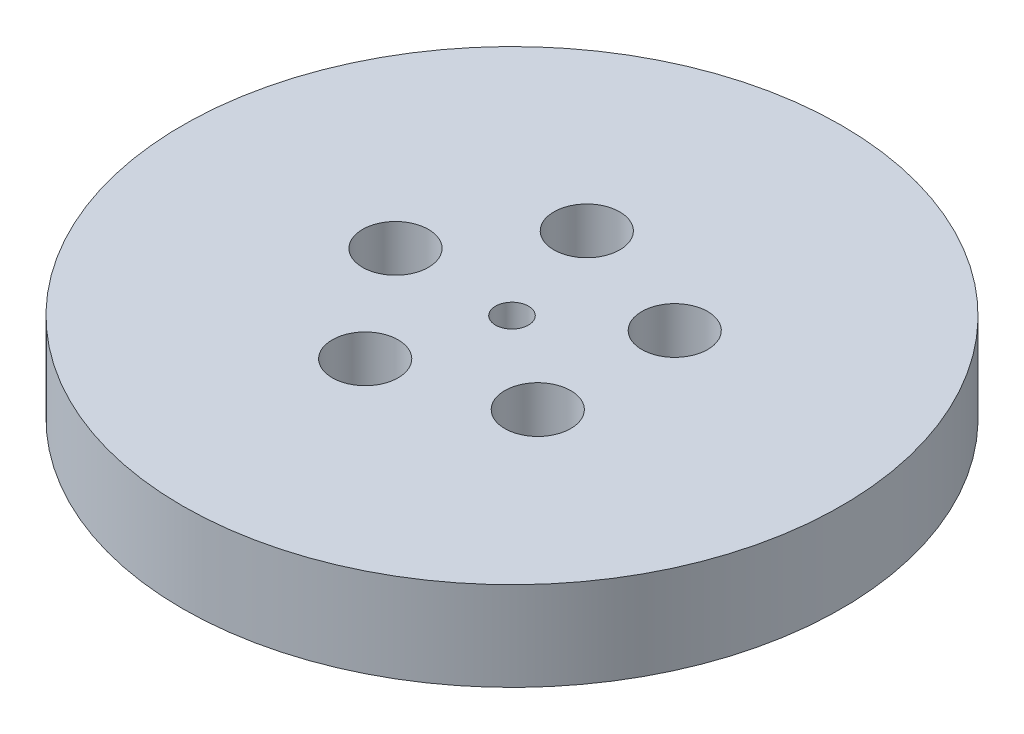
ISO-10303-21;
HEADER;
FILE_DESCRIPTION(('STEP AP214'),'2;1');
FILE_NAME('part.step','',(''),(''),'','','');
FILE_SCHEMA(('AUTOMOTIVE_DESIGN { 1 0 10303 214 1 1 1 1 }'));
ENDSEC;
DATA;
#1=APPLICATION_CONTEXT('core data for automotive mechanical design processes');
#2=APPLICATION_PROTOCOL_DEFINITION('international standard','automotive_design',2000,#1);
#3=PRODUCT_CONTEXT('',#1,'mechanical');
#4=PRODUCT('Part','Part','',(#3));
#5=PRODUCT_RELATED_PRODUCT_CATEGORY('part','',(#4));
#6=PRODUCT_DEFINITION_FORMATION('','',#4);
#7=PRODUCT_DEFINITION_CONTEXT('part definition',#1,'design');
#8=PRODUCT_DEFINITION('design','',#6,#7);
#9=PRODUCT_DEFINITION_SHAPE('','',#8);
#10=(LENGTH_UNIT() NAMED_UNIT(*) SI_UNIT(.MILLI.,.METRE.));
#11=(NAMED_UNIT(*) PLANE_ANGLE_UNIT() SI_UNIT($,.RADIAN.));
#12=(NAMED_UNIT(*) SI_UNIT($,.STERADIAN.) SOLID_ANGLE_UNIT());
#13=UNCERTAINTY_MEASURE_WITH_UNIT(LENGTH_MEASURE(1.E-05),#10,'distance_accuracy_value','');
#14=(GEOMETRIC_REPRESENTATION_CONTEXT(3) GLOBAL_UNCERTAINTY_ASSIGNED_CONTEXT((#13)) GLOBAL_UNIT_ASSIGNED_CONTEXT((#10,
#11,#12)) REPRESENTATION_CONTEXT('',''));
#15=CARTESIAN_POINT('',(0.,0.,0.));
#16=DIRECTION('',(0.,0.,1.));
#17=DIRECTION('',(1.,0.,0.));
#18=AXIS2_PLACEMENT_3D('',#15,#16,#17);
#19=CARTESIAN_POINT('',(0.,27.,0.));
#20=DIRECTION('',(0.,-1.,0.));
#21=DIRECTION('',(0.,0.,-1.));
#22=AXIS2_PLACEMENT_3D('',#19,#20,#21);
#23=CYLINDRICAL_SURFACE('',#22,100.);
#24=CARTESIAN_POINT('',(0.,27.,0.));
#25=DIRECTION('',(0.,1.,0.));
#26=DIRECTION('',(0.,0.,1.));
#27=AXIS2_PLACEMENT_3D('',#24,#25,#26);
#28=CIRCLE('',#27,100.);
#29=CARTESIAN_POINT('',(0.,27.,100.));
#30=VERTEX_POINT('',#29);
#31=EDGE_CURVE('E10',#30,#30,#28,.T.);
#32=ORIENTED_EDGE('',*,*,#31,.F.);
#33=EDGE_LOOP('',(#32));
#34=FACE_BOUND('',#33,.T.);
#35=CARTESIAN_POINT('',(0.,0.,0.));
#36=DIRECTION('',(0.,1.,0.));
#37=DIRECTION('',(0.,0.,1.));
#38=AXIS2_PLACEMENT_3D('',#35,#36,#37);
#39=CIRCLE('',#38,100.);
#40=CARTESIAN_POINT('',(0.,0.,100.));
#41=VERTEX_POINT('',#40);
#42=EDGE_CURVE('E37',#41,#41,#39,.T.);
#43=ORIENTED_EDGE('',*,*,#42,.T.);
#44=EDGE_LOOP('',(#43));
#45=FACE_BOUND('',#44,.T.);
#46=ADVANCED_FACE('F40',(#34,#45),#23,.T.);
#47=CARTESIAN_POINT('',(0.,27.,0.));
#48=DIRECTION('',(0.,1.,0.));
#49=DIRECTION('',(0.,0.,1.));
#50=AXIS2_PLACEMENT_3D('',#47,#48,#49);
#51=PLANE('',#50);
#52=CARTESIAN_POINT('',(-10.9241013557288,27.,-33.620926900959));
#53=DIRECTION('',(0.,1.,0.));
#54=DIRECTION('',(-0.95105651629515,0.,0.309016994374958));
#55=AXIS2_PLACEMENT_3D('',#52,#53,#54);
#56=CIRCLE('',#55,10.);
#57=CARTESIAN_POINT('',(-20.4346665186803,27.,-30.5307569572094));
#58=VERTEX_POINT('',#57);
#59=EDGE_CURVE('E70',#58,#58,#56,.T.);
#60=ORIENTED_EDGE('',*,*,#59,.F.);
#61=EDGE_LOOP('',(#60));
#62=FACE_BOUND('',#61,.T.);
#63=CARTESIAN_POINT('',(28.5996686458455,27.,-20.7788755580686));
#64=DIRECTION('',(0.,1.,0.));
#65=DIRECTION('',(-0.58778525229248,0.,-0.809016994374942));
#66=AXIS2_PLACEMENT_3D('',#63,#64,#65);
#67=CIRCLE('',#66,10.);
#68=CARTESIAN_POINT('',(22.7218161229207,27.,-28.8690455018181));
#69=VERTEX_POINT('',#68);
#70=EDGE_CURVE('E71',#69,#69,#67,.T.);
#71=ORIENTED_EDGE('',*,*,#70,.F.);
#72=EDGE_LOOP('',(#71));
#73=FACE_BOUND('',#72,.T.);
#74=CARTESIAN_POINT('',(28.5996686458458,27.,20.7788755580682));
#75=DIRECTION('',(0.,1.,0.));
#76=DIRECTION('',(0.587785252292469,0.,-0.809016994374951));
#77=AXIS2_PLACEMENT_3D('',#74,#75,#76);
#78=CIRCLE('',#77,10.);
#79=CARTESIAN_POINT('',(34.4775211687705,27.,12.6887056143187));
#80=VERTEX_POINT('',#79);
#81=EDGE_CURVE('E78',#80,#80,#78,.T.);
#82=ORIENTED_EDGE('',*,*,#81,.F.);
#83=EDGE_LOOP('',(#82));
#84=FACE_BOUND('',#83,.T.);
#85=CARTESIAN_POINT('',(-10.9241013557283,27.,33.6209269009591));
#86=DIRECTION('',(0.,1.,0.));
#87=DIRECTION('',(0.951056516295155,0.,0.309016994374945));
#88=AXIS2_PLACEMENT_3D('',#85,#86,#87);
#89=CIRCLE('',#88,10.);
#90=CARTESIAN_POINT('',(-1.41353619277674,27.,36.7110968447086));
#91=VERTEX_POINT('',#90);
#92=EDGE_CURVE('E61',#91,#91,#89,.T.);
#93=ORIENTED_EDGE('',*,*,#92,.F.);
#94=EDGE_LOOP('',(#93));
#95=FACE_BOUND('',#94,.T.);
#96=CARTESIAN_POINT('',(-35.3511345802346,27.,0.));
#97=DIRECTION('',(0.,1.,0.));
#98=DIRECTION('',(0.,0.,1.));
#99=AXIS2_PLACEMENT_3D('',#96,#97,#98);
#100=CIRCLE('',#99,10.);
#101=CARTESIAN_POINT('',(-35.3511345802346,27.,10.));
#102=VERTEX_POINT('',#101);
#103=EDGE_CURVE('E54',#102,#102,#100,.T.);
#104=ORIENTED_EDGE('',*,*,#103,.F.);
#105=EDGE_LOOP('',(#104));
#106=FACE_BOUND('',#105,.T.);
#107=CARTESIAN_POINT('',(0.,27.,0.));
#108=DIRECTION('',(0.,1.,0.));
#109=DIRECTION('',(0.,0.,1.));
#110=AXIS2_PLACEMENT_3D('',#107,#108,#109);
#111=CIRCLE('',#110,5.);
#112=CARTESIAN_POINT('',(0.,27.,5.));
#113=VERTEX_POINT('',#112);
#114=EDGE_CURVE('E50',#113,#113,#111,.T.);
#115=ORIENTED_EDGE('',*,*,#114,.F.);
#116=EDGE_LOOP('',(#115));
#117=FACE_BOUND('',#116,.T.);
#118=ORIENTED_EDGE('',*,*,#31,.T.);
#119=EDGE_LOOP('',(#118));
#120=FACE_BOUND('',#119,.T.);
#121=ADVANCED_FACE('F94',(#62,#73,#84,#95,#106,#117,#120),#51,.T.);
#122=CARTESIAN_POINT('',(0.,0.,0.));
#123=DIRECTION('',(0.,1.,0.));
#124=DIRECTION('',(0.,0.,1.));
#125=AXIS2_PLACEMENT_3D('',#122,#123,#124);
#126=PLANE('',#125);
#127=CARTESIAN_POINT('',(0.,0.,0.));
#128=DIRECTION('',(0.,1.,0.));
#129=DIRECTION('',(0.,0.,1.));
#130=AXIS2_PLACEMENT_3D('',#127,#128,#129);
#131=CIRCLE('',#130,5.);
#132=CARTESIAN_POINT('',(0.,0.,5.));
#133=VERTEX_POINT('',#132);
#134=EDGE_CURVE('E47',#133,#133,#131,.T.);
#135=ORIENTED_EDGE('',*,*,#134,.T.);
#136=EDGE_LOOP('',(#135));
#137=FACE_BOUND('',#136,.T.);
#138=ORIENTED_EDGE('',*,*,#42,.F.);
#139=EDGE_LOOP('',(#138));
#140=FACE_BOUND('',#139,.T.);
#141=ADVANCED_FACE('F100',(#137,#140),#126,.F.);
#142=CARTESIAN_POINT('',(0.,27.,0.));
#143=DIRECTION('',(0.,-1.,0.));
#144=DIRECTION('',(0.,0.,-1.));
#145=AXIS2_PLACEMENT_3D('',#142,#143,#144);
#146=CYLINDRICAL_SURFACE('',#145,5.);
#147=ORIENTED_EDGE('',*,*,#114,.T.);
#148=EDGE_LOOP('',(#147));
#149=FACE_BOUND('',#148,.T.);
#150=ORIENTED_EDGE('',*,*,#134,.F.);
#151=EDGE_LOOP('',(#150));
#152=FACE_BOUND('',#151,.T.);
#153=ADVANCED_FACE('F106',(#149,#152),#146,.F.);
#154=CARTESIAN_POINT('',(-35.3511345802346,4.19967270268255,0.));
#155=DIRECTION('',(0.,1.,0.));
#156=DIRECTION('',(0.,0.,1.));
#157=AXIS2_PLACEMENT_3D('',#154,#155,#156);
#158=CYLINDRICAL_SURFACE('',#157,10.);
#159=CARTESIAN_POINT('',(-35.3511345802346,4.19967270268255,0.));
#160=DIRECTION('',(0.,1.,0.));
#161=DIRECTION('',(0.,0.,1.));
#162=AXIS2_PLACEMENT_3D('',#159,#160,#161);
#163=CIRCLE('',#162,10.);
#164=CARTESIAN_POINT('',(-35.3511345802346,4.19967270268255,10.));
#165=VERTEX_POINT('',#164);
#166=EDGE_CURVE('E55',#165,#165,#163,.T.);
#167=ORIENTED_EDGE('',*,*,#166,.F.);
#168=EDGE_LOOP('',(#167));
#169=FACE_BOUND('',#168,.T.);
#170=ORIENTED_EDGE('',*,*,#103,.T.);
#171=EDGE_LOOP('',(#170));
#172=FACE_BOUND('',#171,.T.);
#173=ADVANCED_FACE('F108',(#169,#172),#158,.F.);
#174=CARTESIAN_POINT('',(-35.3511345802346,4.19967270268255,0.));
#175=DIRECTION('',(0.,1.,0.));
#176=DIRECTION('',(0.,0.,1.));
#177=AXIS2_PLACEMENT_3D('',#174,#175,#176);
#178=PLANE('',#177);
#179=ORIENTED_EDGE('',*,*,#166,.T.);
#180=EDGE_LOOP('',(#179));
#181=FACE_BOUND('',#180,.T.);
#182=ADVANCED_FACE('F138',(#181),#178,.T.);
#183=CARTESIAN_POINT('',(-10.9241013557283,4.19967270268255,33.6209269009591));
#184=DIRECTION('',(0.,1.,0.));
#185=DIRECTION('',(0.,0.,1.));
#186=AXIS2_PLACEMENT_3D('',#183,#184,#185);
#187=CYLINDRICAL_SURFACE('',#186,10.);
#188=CARTESIAN_POINT('',(-10.9241013557283,4.19967270268255,33.6209269009591));
#189=DIRECTION('',(0.,1.,0.));
#190=DIRECTION('',(0.951056516295155,0.,0.309016994374945));
#191=AXIS2_PLACEMENT_3D('',#188,#189,#190);
#192=CIRCLE('',#191,10.);
#193=CARTESIAN_POINT('',(-1.41353619277674,4.19967270268255,36.7110968447086));
#194=VERTEX_POINT('',#193);
#195=EDGE_CURVE('E59',#194,#194,#192,.T.);
#196=ORIENTED_EDGE('',*,*,#195,.F.);
#197=EDGE_LOOP('',(#196));
#198=FACE_BOUND('',#197,.T.);
#199=ORIENTED_EDGE('',*,*,#92,.T.);
#200=EDGE_LOOP('',(#199));
#201=FACE_BOUND('',#200,.T.);
#202=ADVANCED_FACE('F150',(#198,#201),#187,.F.);
#203=CARTESIAN_POINT('',(-10.9241013557283,4.19967270268255,33.6209269009591));
#204=DIRECTION('',(0.,1.,0.));
#205=DIRECTION('',(0.951056516295155,0.,0.309016994374945));
#206=AXIS2_PLACEMENT_3D('',#203,#204,#205);
#207=PLANE('',#206);
#208=ORIENTED_EDGE('',*,*,#195,.T.);
#209=EDGE_LOOP('',(#208));
#210=FACE_BOUND('',#209,.T.);
#211=ADVANCED_FACE('F89',(#210),#207,.T.);
#212=CARTESIAN_POINT('',(28.5996686458458,4.19967270268255,20.7788755580682));
#213=DIRECTION('',(0.,1.,0.));
#214=DIRECTION('',(0.,0.,1.));
#215=AXIS2_PLACEMENT_3D('',#212,#213,#214);
#216=CYLINDRICAL_SURFACE('',#215,10.);
#217=CARTESIAN_POINT('',(28.5996686458458,4.19967270268255,20.7788755580682));
#218=DIRECTION('',(0.,1.,0.));
#219=DIRECTION('',(0.587785252292469,0.,-0.809016994374951));
#220=AXIS2_PLACEMENT_3D('',#217,#218,#219);
#221=CIRCLE('',#220,10.);
#222=CARTESIAN_POINT('',(34.4775211687705,4.19967270268255,12.6887056143187));
#223=VERTEX_POINT('',#222);
#224=EDGE_CURVE('E63',#223,#223,#221,.T.);
#225=ORIENTED_EDGE('',*,*,#224,.F.);
#226=EDGE_LOOP('',(#225));
#227=FACE_BOUND('',#226,.T.);
#228=ORIENTED_EDGE('',*,*,#81,.T.);
#229=EDGE_LOOP('',(#228));
#230=FACE_BOUND('',#229,.T.);
#231=ADVANCED_FACE('F87',(#227,#230),#216,.F.);
#232=CARTESIAN_POINT('',(28.5996686458458,4.19967270268255,20.7788755580682));
#233=DIRECTION('',(0.,1.,0.));
#234=DIRECTION('',(0.587785252292469,0.,-0.809016994374951));
#235=AXIS2_PLACEMENT_3D('',#232,#233,#234);
#236=PLANE('',#235);
#237=ORIENTED_EDGE('',*,*,#224,.T.);
#238=EDGE_LOOP('',(#237));
#239=FACE_BOUND('',#238,.T.);
#240=ADVANCED_FACE('F84',(#239),#236,.T.);
#241=CARTESIAN_POINT('',(28.5996686458455,4.19967270268255,-20.7788755580686));
#242=DIRECTION('',(0.,1.,0.));
#243=DIRECTION('',(0.,0.,1.));
#244=AXIS2_PLACEMENT_3D('',#241,#242,#243);
#245=CYLINDRICAL_SURFACE('',#244,10.);
#246=CARTESIAN_POINT('',(28.5996686458455,4.19967270268255,-20.7788755580686));
#247=DIRECTION('',(0.,1.,0.));
#248=DIRECTION('',(-0.58778525229248,0.,-0.809016994374942));
#249=AXIS2_PLACEMENT_3D('',#246,#247,#248);
#250=CIRCLE('',#249,10.);
#251=CARTESIAN_POINT('',(22.7218161229207,4.19967270268255,-28.8690455018181));
#252=VERTEX_POINT('',#251);
#253=EDGE_CURVE('E76',#252,#252,#250,.T.);
#254=ORIENTED_EDGE('',*,*,#253,.F.);
#255=EDGE_LOOP('',(#254));
#256=FACE_BOUND('',#255,.T.);
#257=ORIENTED_EDGE('',*,*,#70,.T.);
#258=EDGE_LOOP('',(#257));
#259=FACE_BOUND('',#258,.T.);
#260=ADVANCED_FACE('F185',(#256,#259),#245,.F.);
#261=CARTESIAN_POINT('',(28.5996686458455,4.19967270268255,-20.7788755580686));
#262=DIRECTION('',(0.,1.,0.));
#263=DIRECTION('',(-0.58778525229248,0.,-0.809016994374942));
#264=AXIS2_PLACEMENT_3D('',#261,#262,#263);
#265=PLANE('',#264);
#266=ORIENTED_EDGE('',*,*,#253,.T.);
#267=EDGE_LOOP('',(#266));
#268=FACE_BOUND('',#267,.T.);
#269=ADVANCED_FACE('F189',(#268),#265,.T.);
#270=CARTESIAN_POINT('',(-10.9241013557288,4.19967270268255,-33.620926900959));
#271=DIRECTION('',(0.,1.,0.));
#272=DIRECTION('',(0.,0.,1.));
#273=AXIS2_PLACEMENT_3D('',#270,#271,#272);
#274=CYLINDRICAL_SURFACE('',#273,10.);
#275=CARTESIAN_POINT('',(-10.9241013557288,4.19967270268255,-33.620926900959));
#276=DIRECTION('',(0.,1.,0.));
#277=DIRECTION('',(-0.95105651629515,0.,0.309016994374958));
#278=AXIS2_PLACEMENT_3D('',#275,#276,#277);
#279=CIRCLE('',#278,10.);
#280=CARTESIAN_POINT('',(-20.4346665186803,4.19967270268255,-30.5307569572094));
#281=VERTEX_POINT('',#280);
#282=EDGE_CURVE('E69',#281,#281,#279,.T.);
#283=ORIENTED_EDGE('',*,*,#282,.F.);
#284=EDGE_LOOP('',(#283));
#285=FACE_BOUND('',#284,.T.);
#286=ORIENTED_EDGE('',*,*,#59,.T.);
#287=EDGE_LOOP('',(#286));
#288=FACE_BOUND('',#287,.T.);
#289=ADVANCED_FACE('F200',(#285,#288),#274,.F.);
#290=CARTESIAN_POINT('',(-10.9241013557288,4.19967270268255,-33.620926900959));
#291=DIRECTION('',(0.,1.,0.));
#292=DIRECTION('',(-0.95105651629515,0.,0.309016994374958));
#293=AXIS2_PLACEMENT_3D('',#290,#291,#292);
#294=PLANE('',#293);
#295=ORIENTED_EDGE('',*,*,#282,.T.);
#296=EDGE_LOOP('',(#295));
#297=FACE_BOUND('',#296,.T.);
#298=ADVANCED_FACE('F208',(#297),#294,.T.);
#299=CLOSED_SHELL('',(#46,#121,#141,#153,#173,#182,#202,#211,#231,#240,#260,#269,#289,#298));
#300=MANIFOLD_SOLID_BREP('B2',#299);
#301=ADVANCED_BREP_SHAPE_REPRESENTATION('',(#18,#300),#14);
#302=SHAPE_DEFINITION_REPRESENTATION(#9,#301);
ENDSEC;
END-ISO-10303-21;
